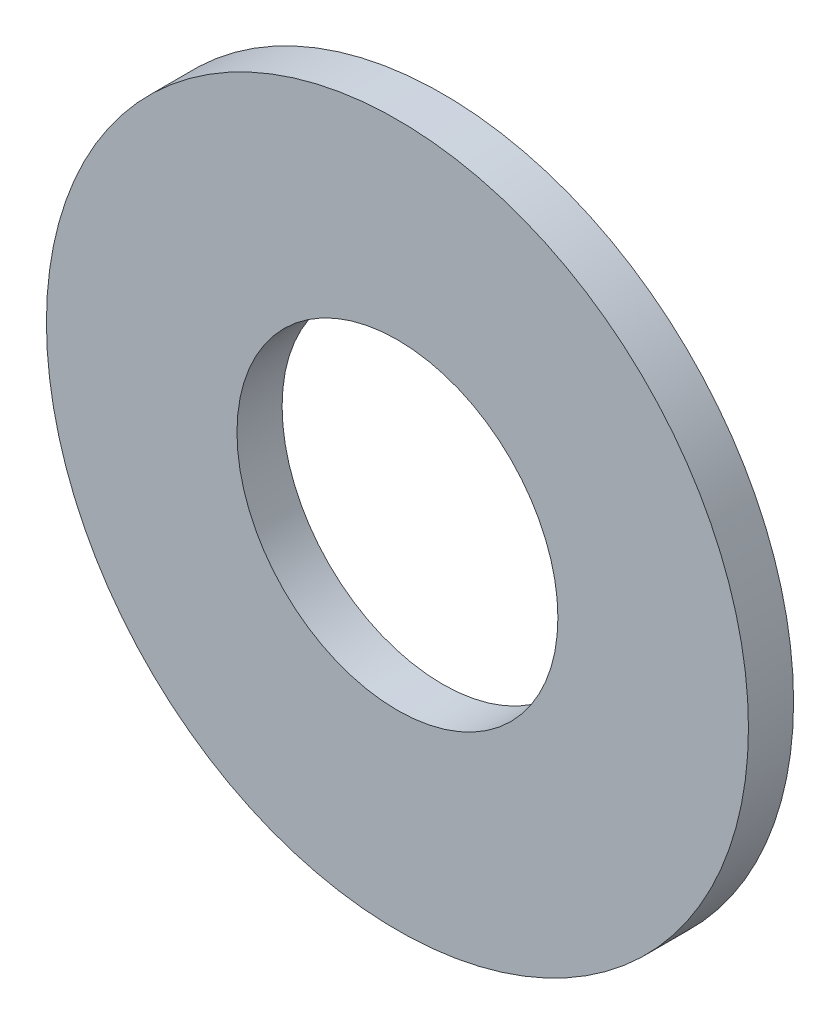
ISO-10303-21;
HEADER;
FILE_DESCRIPTION(('STEP AP214'),'2;1');
FILE_NAME('part.step','',(''),(''),'','','');
FILE_SCHEMA(('AUTOMOTIVE_DESIGN { 1 0 10303 214 1 1 1 1 }'));
ENDSEC;
DATA;
#1=APPLICATION_CONTEXT('core data for automotive mechanical design processes');
#2=APPLICATION_PROTOCOL_DEFINITION('international standard','automotive_design',2000,#1);
#3=PRODUCT_CONTEXT('',#1,'mechanical');
#4=PRODUCT('Part','Part','',(#3));
#5=PRODUCT_RELATED_PRODUCT_CATEGORY('part','',(#4));
#6=PRODUCT_DEFINITION_FORMATION('','',#4);
#7=PRODUCT_DEFINITION_CONTEXT('part definition',#1,'design');
#8=PRODUCT_DEFINITION('design','',#6,#7);
#9=PRODUCT_DEFINITION_SHAPE('','',#8);
#10=(LENGTH_UNIT() NAMED_UNIT(*) SI_UNIT(.MILLI.,.METRE.));
#11=(NAMED_UNIT(*) PLANE_ANGLE_UNIT() SI_UNIT($,.RADIAN.));
#12=(NAMED_UNIT(*) SI_UNIT($,.STERADIAN.) SOLID_ANGLE_UNIT());
#13=UNCERTAINTY_MEASURE_WITH_UNIT(LENGTH_MEASURE(1.E-05),#10,'distance_accuracy_value','');
#14=(GEOMETRIC_REPRESENTATION_CONTEXT(3) GLOBAL_UNCERTAINTY_ASSIGNED_CONTEXT((#13)) GLOBAL_UNIT_ASSIGNED_CONTEXT((#10,
#11,#12)) REPRESENTATION_CONTEXT('',''));
#15=CARTESIAN_POINT('',(0.,0.,0.));
#16=DIRECTION('',(0.,0.,1.));
#17=DIRECTION('',(1.,0.,0.));
#18=AXIS2_PLACEMENT_3D('',#15,#16,#17);
#19=CARTESIAN_POINT('',(0.,0.,-0.45));
#20=DIRECTION('',(0.,0.,1.));
#21=DIRECTION('',(1.,0.,0.));
#22=AXIS2_PLACEMENT_3D('',#19,#20,#21);
#23=CYLINDRICAL_SURFACE('',#22,3.5);
#24=CARTESIAN_POINT('',(0.,0.,-0.45));
#25=DIRECTION('',(0.,0.,1.));
#26=DIRECTION('',(1.,0.,0.));
#27=AXIS2_PLACEMENT_3D('',#24,#25,#26);
#28=CIRCLE('',#27,3.5);
#29=CARTESIAN_POINT('',(3.5,0.,-0.45));
#30=VERTEX_POINT('',#29);
#31=EDGE_CURVE('E10',#30,#30,#28,.T.);
#32=ORIENTED_EDGE('',*,*,#31,.T.);
#33=EDGE_LOOP('',(#32));
#34=FACE_BOUND('',#33,.T.);
#35=CARTESIAN_POINT('',(0.,0.,0.));
#36=DIRECTION('',(0.,0.,1.));
#37=DIRECTION('',(1.,0.,0.));
#38=AXIS2_PLACEMENT_3D('',#35,#36,#37);
#39=CIRCLE('',#38,3.5);
#40=CARTESIAN_POINT('',(3.5,0.,0.));
#41=VERTEX_POINT('',#40);
#42=EDGE_CURVE('E31',#41,#41,#39,.T.);
#43=ORIENTED_EDGE('',*,*,#42,.F.);
#44=EDGE_LOOP('',(#43));
#45=FACE_BOUND('',#44,.T.);
#46=ADVANCED_FACE('F28',(#34,#45),#23,.T.);
#47=CARTESIAN_POINT('',(0.,0.,-0.45));
#48=DIRECTION('',(0.,0.,1.));
#49=DIRECTION('',(1.,0.,0.));
#50=AXIS2_PLACEMENT_3D('',#47,#48,#49);
#51=PLANE('',#50);
#52=CARTESIAN_POINT('',(0.,0.,-0.45));
#53=DIRECTION('',(0.,0.,1.));
#54=DIRECTION('',(1.,0.,0.));
#55=AXIS2_PLACEMENT_3D('',#52,#53,#54);
#56=CIRCLE('',#55,1.6);
#57=CARTESIAN_POINT('',(1.6,0.,-0.45));
#58=VERTEX_POINT('',#57);
#59=EDGE_CURVE('E38',#58,#58,#56,.T.);
#60=ORIENTED_EDGE('',*,*,#59,.T.);
#61=EDGE_LOOP('',(#60));
#62=FACE_BOUND('',#61,.T.);
#63=ORIENTED_EDGE('',*,*,#31,.F.);
#64=EDGE_LOOP('',(#63));
#65=FACE_BOUND('',#64,.T.);
#66=ADVANCED_FACE('F46',(#62,#65),#51,.F.);
#67=CARTESIAN_POINT('',(0.,0.,0.));
#68=DIRECTION('',(0.,0.,1.));
#69=DIRECTION('',(1.,0.,0.));
#70=AXIS2_PLACEMENT_3D('',#67,#68,#69);
#71=PLANE('',#70);
#72=CARTESIAN_POINT('',(0.,0.,0.));
#73=DIRECTION('',(0.,0.,1.));
#74=DIRECTION('',(1.,0.,0.));
#75=AXIS2_PLACEMENT_3D('',#72,#73,#74);
#76=CIRCLE('',#75,1.6);
#77=CARTESIAN_POINT('',(1.6,0.,0.));
#78=VERTEX_POINT('',#77);
#79=EDGE_CURVE('E40',#78,#78,#76,.T.);
#80=ORIENTED_EDGE('',*,*,#79,.F.);
#81=EDGE_LOOP('',(#80));
#82=FACE_BOUND('',#81,.T.);
#83=ORIENTED_EDGE('',*,*,#42,.T.);
#84=EDGE_LOOP('',(#83));
#85=FACE_BOUND('',#84,.T.);
#86=ADVANCED_FACE('F52',(#82,#85),#71,.T.);
#87=CARTESIAN_POINT('',(0.,0.,-0.45));
#88=DIRECTION('',(0.,0.,1.));
#89=DIRECTION('',(1.,0.,0.));
#90=AXIS2_PLACEMENT_3D('',#87,#88,#89);
#91=CYLINDRICAL_SURFACE('',#90,1.6);
#92=ORIENTED_EDGE('',*,*,#59,.F.);
#93=EDGE_LOOP('',(#92));
#94=FACE_BOUND('',#93,.T.);
#95=ORIENTED_EDGE('',*,*,#79,.T.);
#96=EDGE_LOOP('',(#95));
#97=FACE_BOUND('',#96,.T.);
#98=ADVANCED_FACE('F49',(#94,#97),#91,.F.);
#99=CLOSED_SHELL('',(#46,#66,#86,#98));
#100=MANIFOLD_SOLID_BREP('B2',#99);
#101=ADVANCED_BREP_SHAPE_REPRESENTATION('',(#18,#100),#14);
#102=SHAPE_DEFINITION_REPRESENTATION(#9,#101);
ENDSEC;
END-ISO-10303-21;
